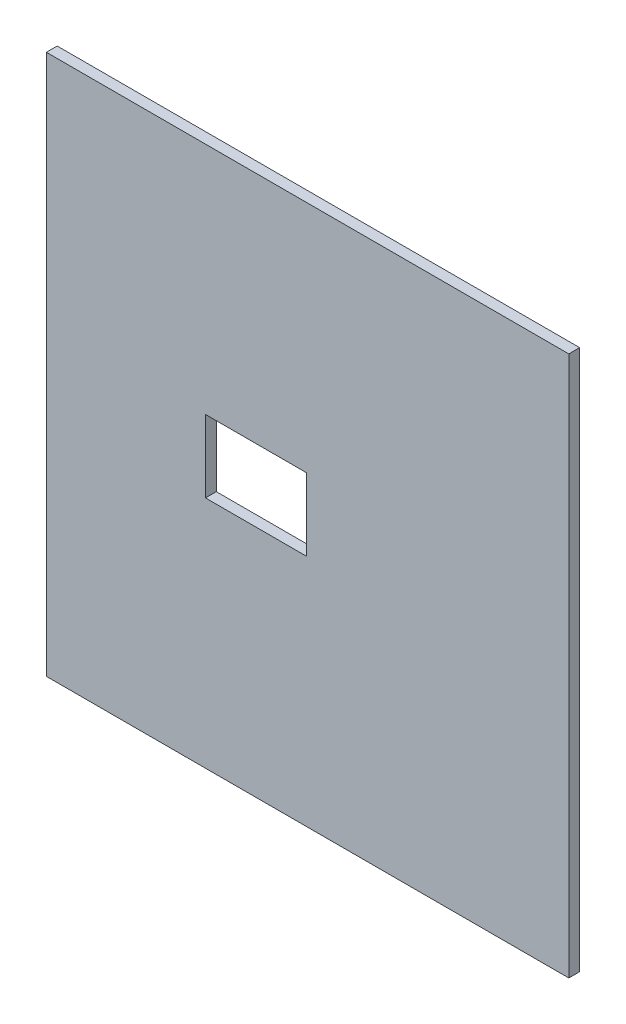
ISO-10303-21;
HEADER;
FILE_DESCRIPTION(('STEP AP214'),'2;1');
FILE_NAME('part.step','',(''),(''),'','','');
FILE_SCHEMA(('AUTOMOTIVE_DESIGN { 1 0 10303 214 1 1 1 1 }'));
ENDSEC;
DATA;
#1=APPLICATION_CONTEXT('core data for automotive mechanical design processes');
#2=APPLICATION_PROTOCOL_DEFINITION('international standard','automotive_design',2000,#1);
#3=PRODUCT_CONTEXT('',#1,'mechanical');
#4=PRODUCT('Part','Part','',(#3));
#5=PRODUCT_RELATED_PRODUCT_CATEGORY('part','',(#4));
#6=PRODUCT_DEFINITION_FORMATION('','',#4);
#7=PRODUCT_DEFINITION_CONTEXT('part definition',#1,'design');
#8=PRODUCT_DEFINITION('design','',#6,#7);
#9=PRODUCT_DEFINITION_SHAPE('','',#8);
#10=(LENGTH_UNIT() NAMED_UNIT(*) SI_UNIT(.MILLI.,.METRE.));
#11=(NAMED_UNIT(*) PLANE_ANGLE_UNIT() SI_UNIT($,.RADIAN.));
#12=(NAMED_UNIT(*) SI_UNIT($,.STERADIAN.) SOLID_ANGLE_UNIT());
#13=UNCERTAINTY_MEASURE_WITH_UNIT(LENGTH_MEASURE(1.E-05),#10,'distance_accuracy_value','');
#14=(GEOMETRIC_REPRESENTATION_CONTEXT(3) GLOBAL_UNCERTAINTY_ASSIGNED_CONTEXT((#13)) GLOBAL_UNIT_ASSIGNED_CONTEXT((#10,
#11,#12)) REPRESENTATION_CONTEXT('',''));
#15=CARTESIAN_POINT('',(0.,0.,0.));
#16=DIRECTION('',(0.,0.,1.));
#17=DIRECTION('',(1.,0.,0.));
#18=AXIS2_PLACEMENT_3D('',#15,#16,#17);
#19=CARTESIAN_POINT('',(72.25,-74.75,3.));
#20=DIRECTION('',(-1.,0.,0.));
#21=DIRECTION('',(0.,0.,1.));
#22=AXIS2_PLACEMENT_3D('',#19,#20,#21);
#23=PLANE('',#22);
#24=DIRECTION('',(0.,1.,0.));
#25=VECTOR('',#24,1.);
#26=CARTESIAN_POINT('',(72.25,-74.75,0.));
#27=LINE('',#26,#25);
#28=CARTESIAN_POINT('',(72.25,-74.75,0.));
#29=VERTEX_POINT('',#28);
#30=CARTESIAN_POINT('',(72.25,74.75,0.));
#31=VERTEX_POINT('',#30);
#32=EDGE_CURVE('E103',#29,#31,#27,.T.);
#33=ORIENTED_EDGE('',*,*,#32,.T.);
#34=DIRECTION('',(0.,0.,-1.));
#35=VECTOR('',#34,1.);
#36=CARTESIAN_POINT('',(72.25,74.75,3.));
#37=LINE('',#36,#35);
#38=CARTESIAN_POINT('',(72.25,74.75,3.));
#39=VERTEX_POINT('',#38);
#40=EDGE_CURVE('E11',#39,#31,#37,.T.);
#41=ORIENTED_EDGE('',*,*,#40,.F.);
#42=DIRECTION('',(0.,1.,0.));
#43=VECTOR('',#42,1.);
#44=CARTESIAN_POINT('',(72.25,-74.75,3.));
#45=LINE('',#44,#43);
#46=CARTESIAN_POINT('',(72.25,-74.75,3.));
#47=VERTEX_POINT('',#46);
#48=EDGE_CURVE('E132',#47,#39,#45,.T.);
#49=ORIENTED_EDGE('',*,*,#48,.F.);
#50=DIRECTION('',(0.,0.,-1.));
#51=VECTOR('',#50,1.);
#52=CARTESIAN_POINT('',(72.25,-74.75,3.));
#53=LINE('',#52,#51);
#54=EDGE_CURVE('E142',#47,#29,#53,.T.);
#55=ORIENTED_EDGE('',*,*,#54,.T.);
#56=EDGE_LOOP('',(#33,#41,#49,#55));
#57=FACE_BOUND('',#56,.T.);
#58=ADVANCED_FACE('F33',(#57),#23,.F.);
#59=CARTESIAN_POINT('',(-72.25,74.75,3.));
#60=DIRECTION('',(0.,-1.,0.));
#61=DIRECTION('',(0.,0.,-1.));
#62=AXIS2_PLACEMENT_3D('',#59,#60,#61);
#63=PLANE('',#62);
#64=DIRECTION('',(-1.,0.,0.));
#65=VECTOR('',#64,1.);
#66=CARTESIAN_POINT('',(-72.25,74.75,0.));
#67=LINE('',#66,#65);
#68=CARTESIAN_POINT('',(-72.25,74.75,0.));
#69=VERTEX_POINT('',#68);
#70=EDGE_CURVE('E145',#31,#69,#67,.T.);
#71=ORIENTED_EDGE('',*,*,#70,.T.);
#72=DIRECTION('',(0.,0.,-1.));
#73=VECTOR('',#72,1.);
#74=CARTESIAN_POINT('',(-72.25,74.75,3.));
#75=LINE('',#74,#73);
#76=CARTESIAN_POINT('',(-72.25,74.75,3.));
#77=VERTEX_POINT('',#76);
#78=EDGE_CURVE('E40',#77,#69,#75,.T.);
#79=ORIENTED_EDGE('',*,*,#78,.F.);
#80=DIRECTION('',(-1.,0.,0.));
#81=VECTOR('',#80,1.);
#82=CARTESIAN_POINT('',(-72.25,74.75,3.));
#83=LINE('',#82,#81);
#84=EDGE_CURVE('E135',#39,#77,#83,.T.);
#85=ORIENTED_EDGE('',*,*,#84,.F.);
#86=ORIENTED_EDGE('',*,*,#40,.T.);
#87=EDGE_LOOP('',(#71,#79,#85,#86));
#88=FACE_BOUND('',#87,.T.);
#89=ADVANCED_FACE('F173',(#88),#63,.F.);
#90=CARTESIAN_POINT('',(-72.25,-74.75,3.));
#91=DIRECTION('',(1.,0.,0.));
#92=DIRECTION('',(0.,0.,-1.));
#93=AXIS2_PLACEMENT_3D('',#90,#91,#92);
#94=PLANE('',#93);
#95=DIRECTION('',(0.,-1.,0.));
#96=VECTOR('',#95,1.);
#97=CARTESIAN_POINT('',(-72.25,-74.75,0.));
#98=LINE('',#97,#96);
#99=CARTESIAN_POINT('',(-72.25,-74.75,0.));
#100=VERTEX_POINT('',#99);
#101=EDGE_CURVE('E147',#69,#100,#98,.T.);
#102=ORIENTED_EDGE('',*,*,#101,.T.);
#103=DIRECTION('',(0.,0.,-1.));
#104=VECTOR('',#103,1.);
#105=CARTESIAN_POINT('',(-72.25,-74.75,3.));
#106=LINE('',#105,#104);
#107=CARTESIAN_POINT('',(-72.25,-74.75,3.));
#108=VERTEX_POINT('',#107);
#109=EDGE_CURVE('E152',#108,#100,#106,.T.);
#110=ORIENTED_EDGE('',*,*,#109,.F.);
#111=DIRECTION('',(0.,-1.,0.));
#112=VECTOR('',#111,1.);
#113=CARTESIAN_POINT('',(-72.25,-74.75,3.));
#114=LINE('',#113,#112);
#115=EDGE_CURVE('E138',#77,#108,#114,.T.);
#116=ORIENTED_EDGE('',*,*,#115,.F.);
#117=ORIENTED_EDGE('',*,*,#78,.T.);
#118=EDGE_LOOP('',(#102,#110,#116,#117));
#119=FACE_BOUND('',#118,.T.);
#120=ADVANCED_FACE('F159',(#119),#94,.F.);
#121=CARTESIAN_POINT('',(-72.25,-74.75,3.));
#122=DIRECTION('',(0.,1.,0.));
#123=DIRECTION('',(0.,0.,1.));
#124=AXIS2_PLACEMENT_3D('',#121,#122,#123);
#125=PLANE('',#124);
#126=DIRECTION('',(1.,0.,0.));
#127=VECTOR('',#126,1.);
#128=CARTESIAN_POINT('',(-72.25,-74.75,0.));
#129=LINE('',#128,#127);
#130=EDGE_CURVE('E136',#100,#29,#129,.T.);
#131=ORIENTED_EDGE('',*,*,#130,.T.);
#132=ORIENTED_EDGE('',*,*,#54,.F.);
#133=DIRECTION('',(1.,0.,0.));
#134=VECTOR('',#133,1.);
#135=CARTESIAN_POINT('',(-72.25,-74.75,3.));
#136=LINE('',#135,#134);
#137=EDGE_CURVE('E140',#108,#47,#136,.T.);
#138=ORIENTED_EDGE('',*,*,#137,.F.);
#139=ORIENTED_EDGE('',*,*,#109,.T.);
#140=EDGE_LOOP('',(#131,#132,#138,#139));
#141=FACE_BOUND('',#140,.T.);
#142=ADVANCED_FACE('F166',(#141),#125,.F.);
#143=CARTESIAN_POINT('',(0.,0.,3.));
#144=DIRECTION('',(0.,0.,-1.));
#145=DIRECTION('',(-1.,0.,0.));
#146=AXIS2_PLACEMENT_3D('',#143,#144,#145);
#147=PLANE('',#146);
#148=DIRECTION('',(-1.,0.,0.));
#149=VECTOR('',#148,1.);
#150=CARTESIAN_POINT('',(-28.25,9.99999999999999,3.));
#151=LINE('',#150,#149);
#152=CARTESIAN_POINT('',(-0.250000000000016,9.99999999999999,3.));
#153=VERTEX_POINT('',#152);
#154=CARTESIAN_POINT('',(-28.25,9.99999999999999,3.));
#155=VERTEX_POINT('',#154);
#156=EDGE_CURVE('E116',#153,#155,#151,.T.);
#157=ORIENTED_EDGE('',*,*,#156,.F.);
#158=DIRECTION('',(0.,1.,0.));
#159=VECTOR('',#158,1.);
#160=CARTESIAN_POINT('',(-0.250000000000016,9.99999999999999,3.));
#161=LINE('',#160,#159);
#162=CARTESIAN_POINT('',(-0.250000000000012,-10.,3.));
#163=VERTEX_POINT('',#162);
#164=EDGE_CURVE('E47',#163,#153,#161,.T.);
#165=ORIENTED_EDGE('',*,*,#164,.F.);
#166=DIRECTION('',(1.,0.,0.));
#167=VECTOR('',#166,1.);
#168=CARTESIAN_POINT('',(-28.25,-10.,3.));
#169=LINE('',#168,#167);
#170=CARTESIAN_POINT('',(-28.25,-10.,3.));
#171=VERTEX_POINT('',#170);
#172=EDGE_CURVE('E109',#171,#163,#169,.T.);
#173=ORIENTED_EDGE('',*,*,#172,.F.);
#174=DIRECTION('',(0.,-1.,0.));
#175=VECTOR('',#174,1.);
#176=CARTESIAN_POINT('',(-28.25,9.99999999999999,3.));
#177=LINE('',#176,#175);
#178=EDGE_CURVE('E123',#155,#171,#177,.T.);
#179=ORIENTED_EDGE('',*,*,#178,.F.);
#180=EDGE_LOOP('',(#157,#165,#173,#179));
#181=FACE_BOUND('',#180,.T.);
#182=ORIENTED_EDGE('',*,*,#48,.T.);
#183=ORIENTED_EDGE('',*,*,#84,.T.);
#184=ORIENTED_EDGE('',*,*,#115,.T.);
#185=ORIENTED_EDGE('',*,*,#137,.T.);
#186=EDGE_LOOP('',(#182,#183,#184,#185));
#187=FACE_BOUND('',#186,.T.);
#188=ADVANCED_FACE('F172',(#181,#187),#147,.F.);
#189=CARTESIAN_POINT('',(0.,0.,0.));
#190=DIRECTION('',(0.,0.,-1.));
#191=DIRECTION('',(-1.,0.,0.));
#192=AXIS2_PLACEMENT_3D('',#189,#190,#191);
#193=PLANE('',#192);
#194=DIRECTION('',(0.,1.,0.));
#195=VECTOR('',#194,1.);
#196=CARTESIAN_POINT('',(-0.250000000000016,9.99999999999999,0.));
#197=LINE('',#196,#195);
#198=CARTESIAN_POINT('',(-0.250000000000014,-10.,0.));
#199=VERTEX_POINT('',#198);
#200=CARTESIAN_POINT('',(-0.250000000000018,9.99999999999999,0.));
#201=VERTEX_POINT('',#200);
#202=EDGE_CURVE('E107',#199,#201,#197,.T.);
#203=ORIENTED_EDGE('',*,*,#202,.T.);
#204=DIRECTION('',(-1.,0.,0.));
#205=VECTOR('',#204,1.);
#206=CARTESIAN_POINT('',(-28.25,9.99999999999999,0.));
#207=LINE('',#206,#205);
#208=CARTESIAN_POINT('',(-28.25,9.99999999999999,0.));
#209=VERTEX_POINT('',#208);
#210=EDGE_CURVE('E96',#201,#209,#207,.T.);
#211=ORIENTED_EDGE('',*,*,#210,.T.);
#212=DIRECTION('',(0.,-1.,0.));
#213=VECTOR('',#212,1.);
#214=CARTESIAN_POINT('',(-28.25,9.99999999999999,0.));
#215=LINE('',#214,#213);
#216=CARTESIAN_POINT('',(-28.25,-10.,0.));
#217=VERTEX_POINT('',#216);
#218=EDGE_CURVE('E118',#209,#217,#215,.T.);
#219=ORIENTED_EDGE('',*,*,#218,.T.);
#220=DIRECTION('',(1.,0.,0.));
#221=VECTOR('',#220,1.);
#222=CARTESIAN_POINT('',(-28.25,-10.,0.));
#223=LINE('',#222,#221);
#224=EDGE_CURVE('E114',#217,#199,#223,.T.);
#225=ORIENTED_EDGE('',*,*,#224,.T.);
#226=EDGE_LOOP('',(#203,#211,#219,#225));
#227=FACE_BOUND('',#226,.T.);
#228=ORIENTED_EDGE('',*,*,#32,.F.);
#229=ORIENTED_EDGE('',*,*,#130,.F.);
#230=ORIENTED_EDGE('',*,*,#101,.F.);
#231=ORIENTED_EDGE('',*,*,#70,.F.);
#232=EDGE_LOOP('',(#228,#229,#230,#231));
#233=FACE_BOUND('',#232,.T.);
#234=ADVANCED_FACE('F112',(#227,#233),#193,.T.);
#235=CARTESIAN_POINT('',(-0.250000000000016,9.99999999999999,-0.00100000000000013));
#236=DIRECTION('',(1.,0.,0.));
#237=DIRECTION('',(0.,1.,0.));
#238=AXIS2_PLACEMENT_3D('',#235,#236,#237);
#239=PLANE('',#238);
#240=DIRECTION('',(0.,0.,1.));
#241=VECTOR('',#240,1.);
#242=CARTESIAN_POINT('',(-0.250000000000012,-10.,-0.00100000000000013));
#243=LINE('',#242,#241);
#244=EDGE_CURVE('E104',#199,#163,#243,.T.);
#245=ORIENTED_EDGE('',*,*,#244,.T.);
#246=ORIENTED_EDGE('',*,*,#164,.T.);
#247=DIRECTION('',(0.,0.,1.));
#248=VECTOR('',#247,1.);
#249=CARTESIAN_POINT('',(-0.250000000000016,9.99999999999999,-0.00100000000000013));
#250=LINE('',#249,#248);
#251=EDGE_CURVE('E98',#201,#153,#250,.T.);
#252=ORIENTED_EDGE('',*,*,#251,.F.);
#253=ORIENTED_EDGE('',*,*,#202,.F.);
#254=EDGE_LOOP('',(#245,#246,#252,#253));
#255=FACE_BOUND('',#254,.T.);
#256=ADVANCED_FACE('F106',(#255),#239,.F.);
#257=CARTESIAN_POINT('',(-28.25,-10.,-0.00100000000000013));
#258=DIRECTION('',(0.,-1.,0.));
#259=DIRECTION('',(0.,0.,-1.));
#260=AXIS2_PLACEMENT_3D('',#257,#258,#259);
#261=PLANE('',#260);
#262=DIRECTION('',(0.,0.,1.));
#263=VECTOR('',#262,1.);
#264=CARTESIAN_POINT('',(-28.25,-10.,-0.00100000000000013));
#265=LINE('',#264,#263);
#266=EDGE_CURVE('E129',#217,#171,#265,.T.);
#267=ORIENTED_EDGE('',*,*,#266,.T.);
#268=ORIENTED_EDGE('',*,*,#172,.T.);
#269=ORIENTED_EDGE('',*,*,#244,.F.);
#270=ORIENTED_EDGE('',*,*,#224,.F.);
#271=EDGE_LOOP('',(#267,#268,#269,#270));
#272=FACE_BOUND('',#271,.T.);
#273=ADVANCED_FACE('F190',(#272),#261,.F.);
#274=CARTESIAN_POINT('',(-28.25,9.99999999999999,-0.00100000000000013));
#275=DIRECTION('',(-1.,0.,0.));
#276=DIRECTION('',(0.,-1.,0.));
#277=AXIS2_PLACEMENT_3D('',#274,#275,#276);
#278=PLANE('',#277);
#279=DIRECTION('',(0.,0.,1.));
#280=VECTOR('',#279,1.);
#281=CARTESIAN_POINT('',(-28.25,9.99999999999999,-0.00100000000000013));
#282=LINE('',#281,#280);
#283=EDGE_CURVE('E55',#209,#155,#282,.T.);
#284=ORIENTED_EDGE('',*,*,#283,.T.);
#285=ORIENTED_EDGE('',*,*,#178,.T.);
#286=ORIENTED_EDGE('',*,*,#266,.F.);
#287=ORIENTED_EDGE('',*,*,#218,.F.);
#288=EDGE_LOOP('',(#284,#285,#286,#287));
#289=FACE_BOUND('',#288,.T.);
#290=ADVANCED_FACE('F193',(#289),#278,.F.);
#291=CARTESIAN_POINT('',(-28.25,9.99999999999999,-0.00100000000000013));
#292=DIRECTION('',(0.,1.,0.));
#293=DIRECTION('',(-1.,0.,0.));
#294=AXIS2_PLACEMENT_3D('',#291,#292,#293);
#295=PLANE('',#294);
#296=ORIENTED_EDGE('',*,*,#251,.T.);
#297=ORIENTED_EDGE('',*,*,#156,.T.);
#298=ORIENTED_EDGE('',*,*,#283,.F.);
#299=ORIENTED_EDGE('',*,*,#210,.F.);
#300=EDGE_LOOP('',(#296,#297,#298,#299));
#301=FACE_BOUND('',#300,.T.);
#302=ADVANCED_FACE('F97',(#301),#295,.F.);
#303=CLOSED_SHELL('',(#58,#89,#120,#142,#188,#234,#256,#273,#290,#302));
#304=MANIFOLD_SOLID_BREP('B2',#303);
#305=ADVANCED_BREP_SHAPE_REPRESENTATION('',(#18,#304),#14);
#306=SHAPE_DEFINITION_REPRESENTATION(#9,#305);
ENDSEC;
END-ISO-10303-21;
